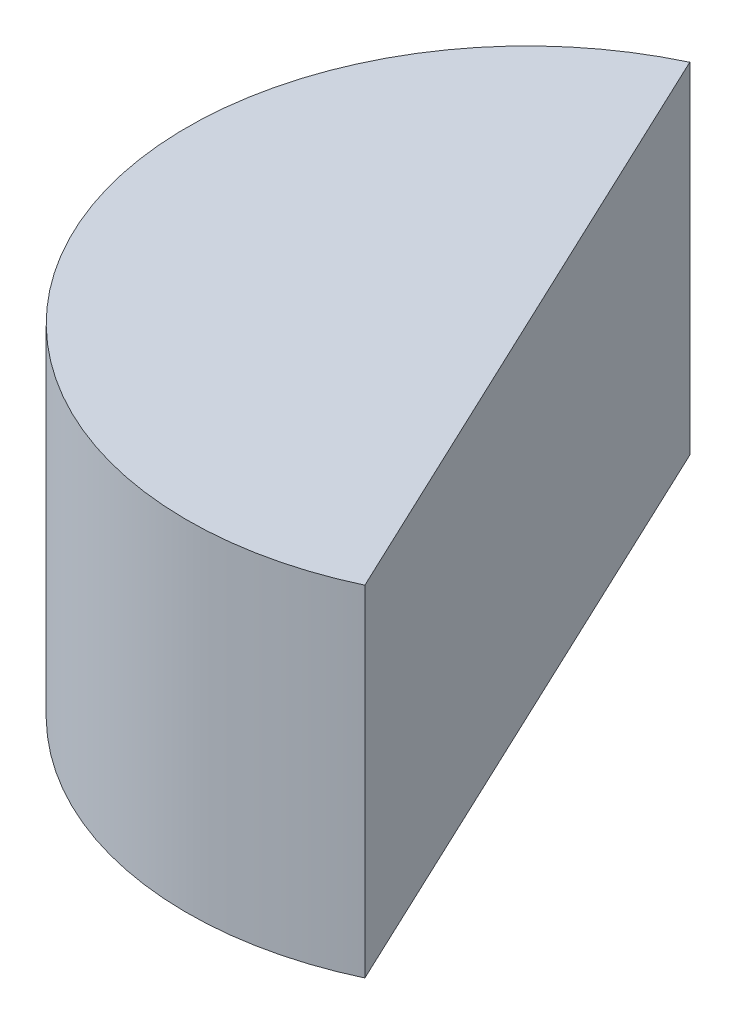
ISO-10303-21;
HEADER;
FILE_DESCRIPTION(('STEP AP214'),'2;1');
FILE_NAME('part.step','',(''),(''),'','','');
FILE_SCHEMA(('AUTOMOTIVE_DESIGN { 1 0 10303 214 1 1 1 1 }'));
ENDSEC;
DATA;
#1=APPLICATION_CONTEXT('core data for automotive mechanical design processes');
#2=APPLICATION_PROTOCOL_DEFINITION('international standard','automotive_design',2000,#1);
#3=PRODUCT_CONTEXT('',#1,'mechanical');
#4=PRODUCT('Part','Part','',(#3));
#5=PRODUCT_RELATED_PRODUCT_CATEGORY('part','',(#4));
#6=PRODUCT_DEFINITION_FORMATION('','',#4);
#7=PRODUCT_DEFINITION_CONTEXT('part definition',#1,'design');
#8=PRODUCT_DEFINITION('design','',#6,#7);
#9=PRODUCT_DEFINITION_SHAPE('','',#8);
#10=(LENGTH_UNIT() NAMED_UNIT(*) SI_UNIT(.MILLI.,.METRE.));
#11=(NAMED_UNIT(*) PLANE_ANGLE_UNIT() SI_UNIT($,.RADIAN.));
#12=(NAMED_UNIT(*) SI_UNIT($,.STERADIAN.) SOLID_ANGLE_UNIT());
#13=UNCERTAINTY_MEASURE_WITH_UNIT(LENGTH_MEASURE(1.E-05),#10,'distance_accuracy_value','');
#14=(GEOMETRIC_REPRESENTATION_CONTEXT(3) GLOBAL_UNCERTAINTY_ASSIGNED_CONTEXT((#13)) GLOBAL_UNIT_ASSIGNED_CONTEXT((#10,
#11,#12)) REPRESENTATION_CONTEXT('',''));
#15=CARTESIAN_POINT('',(0.,0.,0.));
#16=DIRECTION('',(0.,0.,1.));
#17=DIRECTION('',(1.,0.,0.));
#18=AXIS2_PLACEMENT_3D('',#15,#16,#17);
#19=CARTESIAN_POINT('',(-6.66133814775094E-13,38.1,8.88178419700125E-13));
#20=DIRECTION('',(0.,-0.999999999999999,0.));
#21=DIRECTION('',(0.,0.,-1.));
#22=AXIS2_PLACEMENT_3D('',#19,#20,#21);
#23=CYLINDRICAL_SURFACE('',#22,38.1);
#24=CARTESIAN_POINT('',(0.,0.,0.));
#25=DIRECTION('',(0.,0.999999999999999,0.));
#26=DIRECTION('',(0.,0.,1.));
#27=AXIS2_PLACEMENT_3D('',#24,#25,#26);
#28=CIRCLE('',#27,38.1);
#29=CARTESIAN_POINT('',(-16.2620826645097,0.,-34.4551109040822));
#30=VERTEX_POINT('',#29);
#31=CARTESIAN_POINT('',(16.2620826645152,-3.10862446895044E-12,34.4551109040806));
#32=VERTEX_POINT('',#31);
#33=EDGE_CURVE('E77',#30,#32,#28,.T.);
#34=ORIENTED_EDGE('',*,*,#33,.T.);
#35=DIRECTION('',(0.,-0.999999999999999,0.));
#36=VECTOR('',#35,1.);
#37=CARTESIAN_POINT('',(16.2620826645137,38.0999999999969,34.4551109040843));
#38=LINE('',#37,#36);
#39=CARTESIAN_POINT('',(16.2620826645137,38.0999999999969,34.4551109040843));
#40=VERTEX_POINT('',#39);
#41=EDGE_CURVE('E13',#40,#32,#38,.T.);
#42=ORIENTED_EDGE('',*,*,#41,.F.);
#43=CARTESIAN_POINT('',(-6.66133814775094E-13,38.1,8.88178419700125E-13));
#44=DIRECTION('',(0.,0.999999999999999,0.));
#45=DIRECTION('',(0.,0.,1.));
#46=AXIS2_PLACEMENT_3D('',#43,#44,#45);
#47=CIRCLE('',#46,38.1);
#48=CARTESIAN_POINT('',(-16.262082664511,38.1,-34.4551109040803));
#49=VERTEX_POINT('',#48);
#50=EDGE_CURVE('E76',#49,#40,#47,.T.);
#51=ORIENTED_EDGE('',*,*,#50,.F.);
#52=DIRECTION('',(0.,-0.999999999999999,0.));
#53=VECTOR('',#52,1.);
#54=CARTESIAN_POINT('',(-16.262082664511,38.1,-34.4551109040803));
#55=LINE('',#54,#53);
#56=EDGE_CURVE('E54',#49,#30,#55,.T.);
#57=ORIENTED_EDGE('',*,*,#56,.T.);
#58=EDGE_LOOP('',(#34,#42,#51,#57));
#59=FACE_BOUND('',#58,.T.);
#60=ADVANCED_FACE('F46',(#59),#23,.T.);
#61=CARTESIAN_POINT('',(16.2620826645137,38.0999999999969,34.4551109040843));
#62=DIRECTION('',(-0.904333619529711,0.,0.426826316653853));
#63=DIRECTION('',(0.426826316653853,0.,0.904333619529714));
#64=AXIS2_PLACEMENT_3D('',#61,#62,#63);
#65=PLANE('',#64);
#66=DIRECTION('',(-0.426826316653853,0.,-0.904333619529714));
#67=VECTOR('',#66,1.);
#68=CARTESIAN_POINT('',(16.2620826645152,-3.10862446895044E-12,34.4551109040806));
#69=LINE('',#68,#67);
#70=EDGE_CURVE('E69',#32,#30,#69,.T.);
#71=ORIENTED_EDGE('',*,*,#70,.T.);
#72=ORIENTED_EDGE('',*,*,#56,.F.);
#73=DIRECTION('',(-0.426826316653853,0.,-0.904333619529714));
#74=VECTOR('',#73,1.);
#75=CARTESIAN_POINT('',(16.2620826645137,38.0999999999969,34.4551109040843));
#76=LINE('',#75,#74);
#77=EDGE_CURVE('E61',#40,#49,#76,.T.);
#78=ORIENTED_EDGE('',*,*,#77,.F.);
#79=ORIENTED_EDGE('',*,*,#41,.T.);
#80=EDGE_LOOP('',(#71,#72,#78,#79));
#81=FACE_BOUND('',#80,.T.);
#82=ADVANCED_FACE('F72',(#81),#65,.F.);
#83=CARTESIAN_POINT('',(-6.66133814775094E-13,38.1,8.88178419700125E-13));
#84=DIRECTION('',(0.,0.999999999999999,0.));
#85=DIRECTION('',(0.,0.,1.));
#86=AXIS2_PLACEMENT_3D('',#83,#84,#85);
#87=PLANE('',#86);
#88=ORIENTED_EDGE('',*,*,#50,.T.);
#89=ORIENTED_EDGE('',*,*,#77,.T.);
#90=EDGE_LOOP('',(#88,#89));
#91=FACE_BOUND('',#90,.T.);
#92=ADVANCED_FACE('F84',(#91),#87,.T.);
#93=CARTESIAN_POINT('',(0.,0.,0.));
#94=DIRECTION('',(0.,0.999999999999999,0.));
#95=DIRECTION('',(0.,0.,1.));
#96=AXIS2_PLACEMENT_3D('',#93,#94,#95);
#97=PLANE('',#96);
#98=ORIENTED_EDGE('',*,*,#33,.F.);
#99=ORIENTED_EDGE('',*,*,#70,.F.);
#100=EDGE_LOOP('',(#98,#99));
#101=FACE_BOUND('',#100,.T.);
#102=ADVANCED_FACE('F80',(#101),#97,.F.);
#103=CLOSED_SHELL('',(#60,#82,#92,#102));
#104=MANIFOLD_SOLID_BREP('B2',#103);
#105=ADVANCED_BREP_SHAPE_REPRESENTATION('',(#18,#104),#14);
#106=SHAPE_DEFINITION_REPRESENTATION(#9,#105);
ENDSEC;
END-ISO-10303-21;
